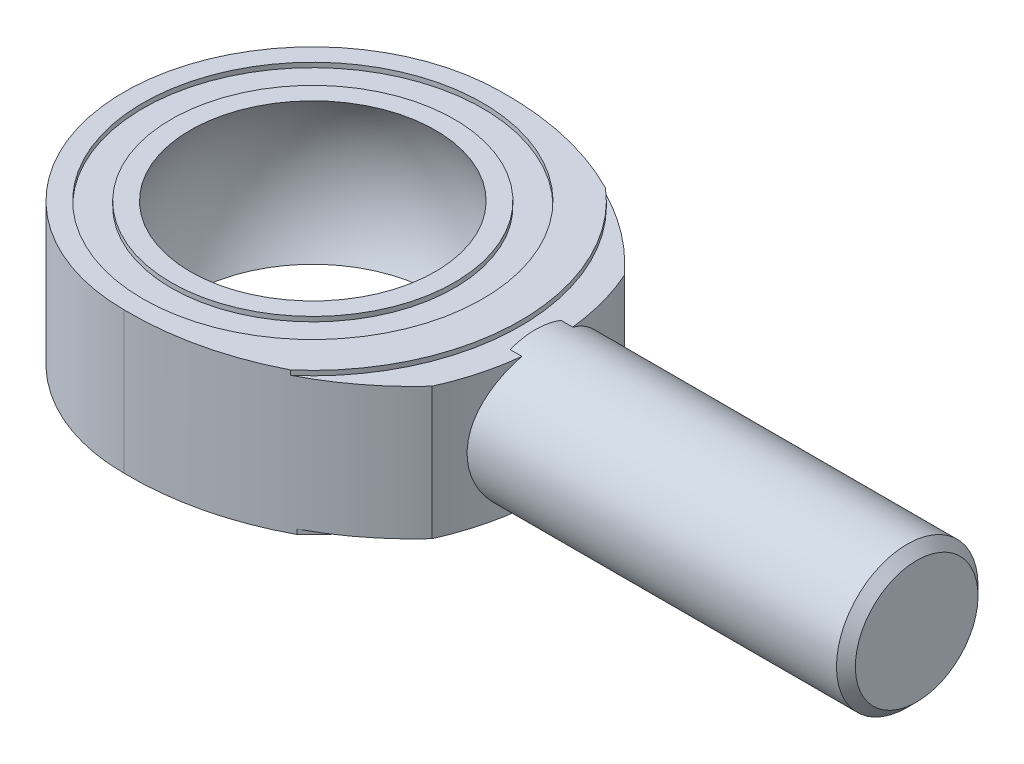
ISO-10303-21;
HEADER;
FILE_DESCRIPTION(('STEP AP214'),'2;1');
FILE_NAME('part.step','',(''),(''),'','','');
FILE_SCHEMA(('AUTOMOTIVE_DESIGN { 1 0 10303 214 1 1 1 1 }'));
ENDSEC;
DATA;
#1=APPLICATION_CONTEXT('core data for automotive mechanical design processes');
#2=APPLICATION_PROTOCOL_DEFINITION('international standard','automotive_design',2000,#1);
#3=PRODUCT_CONTEXT('',#1,'mechanical');
#4=PRODUCT('Part','Part','',(#3));
#5=PRODUCT_RELATED_PRODUCT_CATEGORY('part','',(#4));
#6=PRODUCT_DEFINITION_FORMATION('','',#4);
#7=PRODUCT_DEFINITION_CONTEXT('part definition',#1,'design');
#8=PRODUCT_DEFINITION('design','',#6,#7);
#9=PRODUCT_DEFINITION_SHAPE('','',#8);
#10=(LENGTH_UNIT() NAMED_UNIT(*) SI_UNIT(.MILLI.,.METRE.));
#11=(NAMED_UNIT(*) PLANE_ANGLE_UNIT() SI_UNIT($,.RADIAN.));
#12=(NAMED_UNIT(*) SI_UNIT($,.STERADIAN.) SOLID_ANGLE_UNIT());
#13=UNCERTAINTY_MEASURE_WITH_UNIT(LENGTH_MEASURE(1.E-05),#10,'distance_accuracy_value','');
#14=(GEOMETRIC_REPRESENTATION_CONTEXT(3) GLOBAL_UNCERTAINTY_ASSIGNED_CONTEXT((#13)) GLOBAL_UNIT_ASSIGNED_CONTEXT((#10,
#11,#12)) REPRESENTATION_CONTEXT('',''));
#15=CARTESIAN_POINT('',(0.,0.,0.));
#16=DIRECTION('',(0.,0.,1.));
#17=DIRECTION('',(1.,0.,0.));
#18=AXIS2_PLACEMENT_3D('',#15,#16,#17);
#19=CARTESIAN_POINT('',(0.,8.89,0.));
#20=DIRECTION('',(0.,-1.,0.));
#21=DIRECTION('',(0.,0.,-1.));
#22=AXIS2_PLACEMENT_3D('',#19,#20,#21);
#23=CYLINDRICAL_SURFACE('',#22,15.875);
#24=CARTESIAN_POINT('',(0.,0.,0.));
#25=DIRECTION('',(0.,1.,0.));
#26=DIRECTION('',(0.,0.,1.));
#27=AXIS2_PLACEMENT_3D('',#24,#25,#26);
#28=CIRCLE('',#27,15.875);
#29=CARTESIAN_POINT('',(14.4997686155587,0.,6.46315210212935));
#30=VERTEX_POINT('',#29);
#31=CARTESIAN_POINT('',(15.7826564224784,0.,1.70978982626521));
#32=VERTEX_POINT('',#31);
#33=EDGE_CURVE('E248',#30,#32,#28,.T.);
#34=ORIENTED_EDGE('',*,*,#33,.T.);
#35=CARTESIAN_POINT('',(15.143784822494,4.445,-4.7625));
#36=CARTESIAN_POINT('',(15.1437875218597,4.1840323102802,-4.76249674987404));
#37=CARTESIAN_POINT('',(15.1506043891455,3.92303246334201,-4.74097693430731));
#38=CARTESIAN_POINT('',(15.1770263611095,3.4086633325463,-4.65568806118374));
#39=CARTESIAN_POINT('',(15.1966357386656,3.15529662785804,-4.59190488696095));
#40=CARTESIAN_POINT('',(15.2462262539208,2.66371473773706,-4.42444991632123));
#41=CARTESIAN_POINT('',(15.2761901328282,2.4254751159149,-4.32084446326727));
#42=CARTESIAN_POINT('',(15.3430901083847,1.96970035956497,-4.07690389589421));
#43=CARTESIAN_POINT('',(15.3800272485522,1.75216833117692,-3.93656328310141));
#44=CARTESIAN_POINT('',(15.4580228743982,1.33709920991682,-3.61838094399666));
#45=CARTESIAN_POINT('',(15.4991691638945,1.14031427402053,-3.43957932783186));
#46=CARTESIAN_POINT('',(15.580196866492,0.779024504551037,-3.05160755431522));
#47=CARTESIAN_POINT('',(15.6200781164521,0.614523820321635,-2.84243349933903));
#48=CARTESIAN_POINT('',(15.6950795628956,0.31920592802925,-2.39430381499497));
#49=CARTESIAN_POINT('',(15.7300842478713,0.18915562739408,-2.15482176774121));
#50=CARTESIAN_POINT('',(15.7903683404817,-0.0285345474607519,-1.6561582490477));
#51=CARTESIAN_POINT('',(15.8156498453165,-0.1161835682974,-1.39698104013162));
#52=CARTESIAN_POINT('',(15.8530177606139,-0.244094003462367,-0.874153232102885));
#53=CARTESIAN_POINT('',(15.8654609464764,-0.285639280297336,-0.610842691678321));
#54=CARTESIAN_POINT('',(15.8770066476678,-0.324222505752444,-0.0807142904040737));
#55=CARTESIAN_POINT('',(15.8761119650445,-0.321269802601214,0.186102822009928));
#56=CARTESIAN_POINT('',(15.8613349212105,-0.271802642375919,0.706663422205498));
#57=CARTESIAN_POINT('',(15.8478670915163,-0.226678509653732,0.960552649761222));
#58=CARTESIAN_POINT('',(15.8099608270755,-0.0964205082180648,1.45697325268006));
#59=CARTESIAN_POINT('',(15.7855216975838,-0.0112841057567724,1.69950390770017));
#60=CARTESIAN_POINT('',(15.7278457663334,0.197523174353669,2.16962776116518));
#61=CARTESIAN_POINT('',(15.6945098122253,0.321631318912136,2.39701408040446));
#62=CARTESIAN_POINT('',(15.6225760905863,0.60451318146056,2.82817783926202));
#63=CARTESIAN_POINT('',(15.5839770755373,0.763295123662561,3.03194966022089));
#64=CARTESIAN_POINT('',(15.5038917279599,1.11822785863268,3.41839702885516));
#65=CARTESIAN_POINT('',(15.4623514513069,1.31558321790561,3.59995654276612));
#66=CARTESIAN_POINT('',(15.3823663615776,1.73834430681472,3.92771793639682));
#67=CARTESIAN_POINT('',(15.3439218563742,1.96375282066241,4.0739163023583));
#68=CARTESIAN_POINT('',(15.2742234259604,2.43916031482456,4.32796935187849));
#69=CARTESIAN_POINT('',(15.2430419874785,2.68937437044276,4.43544290820137));
#70=CARTESIAN_POINT('',(15.1922604613002,3.20550288663602,4.60639677129299));
#71=CARTESIAN_POINT('',(15.1726565957717,3.47141219456815,4.66989142981197));
#72=CARTESIAN_POINT('',(15.1480789734703,4.00076149538512,4.74899895648147));
#73=CARTESIAN_POINT('',(15.1425871479299,4.26392411087354,4.76630829757781));
#74=CARTESIAN_POINT('',(15.1454228598877,4.78940145752118,4.75729132464364));
#75=CARTESIAN_POINT('',(15.1537484629337,5.05171630221775,4.73097111878812));
#76=CARTESIAN_POINT('',(15.1827724841554,5.56097560006013,4.63695299348211));
#77=CARTESIAN_POINT('',(15.2031438541227,5.80814232153739,4.57034777544357));
#78=CARTESIAN_POINT('',(15.2536252340815,6.28777536833666,4.39891734349667));
#79=CARTESIAN_POINT('',(15.2837367476479,6.52023941739612,4.2940862283825));
#80=CARTESIAN_POINT('',(15.3513102619845,6.97076794842921,4.045961910489));
#81=CARTESIAN_POINT('',(15.3889478564668,7.18827848912994,3.90171191248418));
#82=CARTESIAN_POINT('',(15.4669555292911,7.596625987124,3.57998082581218));
#83=CARTESIAN_POINT('',(15.5073262601774,7.78745654092059,3.40249178323296));
#84=CARTESIAN_POINT('',(15.5880953651542,8.1444477884618,3.01134504566719));
#85=CARTESIAN_POINT('',(15.6284372807504,8.30940562203367,2.79657513409736));
#86=CARTESIAN_POINT('',(15.7030690430196,8.60096927576311,2.34144116607404));
#87=CARTESIAN_POINT('',(15.7373591902148,8.72757700055614,2.10107838147702));
#88=CARTESIAN_POINT('',(15.7958145625799,8.93762509705434,1.60317022743908));
#89=CARTESIAN_POINT('',(15.8200551462426,9.02138790130475,1.34577017497014));
#90=CARTESIAN_POINT('',(15.8560128521993,9.14419341747708,0.819689643652063));
#91=CARTESIAN_POINT('',(15.8677335575506,9.18324892438621,0.551012415101359));
#92=CARTESIAN_POINT('',(15.8771127745843,9.21455816487305,0.0211205885777199));
#93=CARTESIAN_POINT('',(15.8752954372839,9.20855630791993,-0.239982943598664));
#94=CARTESIAN_POINT('',(15.8590381467654,9.15409131681523,-0.757299352697026));
#95=CARTESIAN_POINT('',(15.8445989092442,9.10563059019938,-1.01351250607539));
#96=CARTESIAN_POINT('',(15.8048695953749,8.96870297505641,-1.51109620640615));
#97=CARTESIAN_POINT('',(15.7796977045951,8.88067127644018,-1.75259659434008));
#98=CARTESIAN_POINT('',(15.7211059415099,8.66748992143887,-2.21752552986336));
#99=CARTESIAN_POINT('',(15.6876847139384,8.54233416533836,-2.44095109996279));
#100=CARTESIAN_POINT('',(15.6147759150177,8.25381427266272,-2.87115850843302));
#101=CARTESIAN_POINT('',(15.575128454715,8.08935570975926,-3.07717904398516));
#102=CARTESIAN_POINT('',(15.4947473065996,7.72886951703167,-3.45928178903196));
#103=CARTESIAN_POINT('',(15.4540133087578,7.53283279462967,-3.63535534551822));
#104=CARTESIAN_POINT('',(15.374641609628,7.10774302890459,-3.95783655324734));
#105=CARTESIAN_POINT('',(15.3361025714441,6.87788009314596,-4.10320362219627));
#106=CARTESIAN_POINT('',(15.2670683818406,6.39586232220172,-4.35306195441919));
#107=CARTESIAN_POINT('',(15.2365693675568,6.14371827011133,-4.45757285891277));
#108=CARTESIAN_POINT('',(15.190083181138,5.65232412961646,-4.61333667544683));
#109=CARTESIAN_POINT('',(15.1728854162817,5.41461754598507,-4.6691187736135));
#110=CARTESIAN_POINT('',(15.1497361023649,4.93294916858495,-4.74369824800893));
#111=CARTESIAN_POINT('',(15.1437822987541,4.68898863875383,-4.76250303866662));
#112=CARTESIAN_POINT('',(15.143784822494,4.445,-4.7625));
#113=B_SPLINE_CURVE_WITH_KNOTS('',3,(#35,#36,#37,#38,#39,#40,#41,#42,#43,#44,#45,#46,#47,#48,
#49,#50,#51,#52,#53,#54,#55,#56,#57,#58,#59,#60,#61,#62,#63,#64,#65,#66,#67,#68,#69,#70,#71,#72,
#73,#74,#75,#76,#77,#78,#79,#80,#81,#82,#83,#84,#85,#86,#87,#88,#89,#90,#91,#92,#93,#94,#95,#96,
#97,#98,#99,#100,#101,#102,#103,#104,#105,#106,#107,#108,#109,#110,#111,#112),.UNSPECIFIED.,.T.,
.F.,(4,2,2,2,2,2,2,2,2,2,2,2,2,2,2,2,2,2,2,2,2,2,2,2,2,2,2,2,2,2,2,2,2,2,2,2,2,2,4),(0.,
0.782003026781847,1.56426738736257,2.34523411593016,3.12631780555007,3.92979751275349,
4.73338041991291,5.55358107193821,6.37360471491509,7.17017044974845,7.96656884272073,
8.73760400021044,9.50868798951944,10.2887528964077,11.0690030267589,11.8793306679891,
12.6897387966166,13.5079180643571,14.3258302075348,15.113256565175,15.9005726917423,
16.6674353893901,17.4344165232865,18.2219832350308,19.009738648326,19.8272243187768,
20.6446693826261,21.4558686901875,22.2668357787961,23.0465726492639,23.8262653093489,
24.5975853257757,25.369032145184,26.1651631590627,26.9615238210817,27.7816195595954,
28.6013205584787,29.3325916350974,30.063716067439),.UNSPECIFIED.);
#114=CARTESIAN_POINT('',(15.7826564224784,8.89,1.70978982626521));
#115=VERTEX_POINT('',#114);
#116=EDGE_CURVE('E170',#32,#115,#113,.T.);
#117=ORIENTED_EDGE('',*,*,#116,.T.);
#118=CARTESIAN_POINT('',(0.,8.89,0.));
#119=DIRECTION('',(0.,1.,0.));
#120=DIRECTION('',(0.,0.,1.));
#121=AXIS2_PLACEMENT_3D('',#118,#119,#120);
#122=CIRCLE('',#121,15.875);
#123=CARTESIAN_POINT('',(14.4997686155587,8.89,6.46315210212935));
#124=VERTEX_POINT('',#123);
#125=EDGE_CURVE('E247',#124,#115,#122,.T.);
#126=ORIENTED_EDGE('',*,*,#125,.F.);
#127=DIRECTION('',(0.,-1.,0.));
#128=VECTOR('',#127,1.);
#129=CARTESIAN_POINT('',(14.4997686155587,9.2075,6.46315210212935));
#130=LINE('',#129,#128);
#131=EDGE_CURVE('E411',#124,#30,#130,.T.);
#132=ORIENTED_EDGE('',*,*,#131,.T.);
#133=EDGE_LOOP('',(#34,#117,#126,#132));
#134=FACE_BOUND('',#133,.T.);
#135=ADVANCED_FACE('F48',(#134),#23,.T.);
#136=CARTESIAN_POINT('',(0.,9.2075,0.));
#137=DIRECTION('',(0.,1.,0.));
#138=DIRECTION('',(0.,0.,1.));
#139=AXIS2_PLACEMENT_3D('',#136,#137,#138);
#140=PLANE('',#139);
#141=CARTESIAN_POINT('',(0.,9.2075,0.));
#142=DIRECTION('',(0.,1.,0.));
#143=DIRECTION('',(0.,0.,1.));
#144=AXIS2_PLACEMENT_3D('',#141,#142,#143);
#145=CIRCLE('',#144,8.24889197104678);
#146=CARTESIAN_POINT('',(0.,9.2075,8.24889197104678));
#147=VERTEX_POINT('',#146);
#148=EDGE_CURVE('E400',#147,#147,#145,.F.);
#149=ORIENTED_EDGE('',*,*,#148,.T.);
#150=EDGE_LOOP('',(#149));
#151=FACE_BOUND('',#150,.T.);
#152=CARTESIAN_POINT('',(0.,9.2075,0.));
#153=DIRECTION('',(0.,1.,0.));
#154=DIRECTION('',(0.,0.,1.));
#155=AXIS2_PLACEMENT_3D('',#152,#153,#154);
#156=CIRCLE('',#155,9.525);
#157=CARTESIAN_POINT('',(0.,9.2075,9.525));
#158=VERTEX_POINT('',#157);
#159=EDGE_CURVE('E386',#158,#158,#156,.T.);
#160=ORIENTED_EDGE('',*,*,#159,.T.);
#161=EDGE_LOOP('',(#160));
#162=FACE_BOUND('',#161,.T.);
#163=ADVANCED_FACE('F220',(#151,#162),#140,.T.);
#164=CARTESIAN_POINT('',(15.7826564224784,8.89,-1.70978982626521));
#165=VERTEX_POINT('',#164);
#166=CARTESIAN_POINT('',(14.4997686155587,8.89,-6.46315210212936));
#167=VERTEX_POINT('',#166);
#168=EDGE_CURVE('E242',#165,#167,#122,.T.);
#169=ORIENTED_EDGE('',*,*,#168,.F.);
#170=CARTESIAN_POINT('',(15.7826564224784,0.,-1.70978982626521));
#171=VERTEX_POINT('',#170);
#172=EDGE_CURVE('E163',#165,#171,#113,.T.);
#173=ORIENTED_EDGE('',*,*,#172,.T.);
#174=CARTESIAN_POINT('',(14.4997686155587,0.,-6.46315210212936));
#175=VERTEX_POINT('',#174);
#176=EDGE_CURVE('E141',#171,#175,#28,.T.);
#177=ORIENTED_EDGE('',*,*,#176,.T.);
#178=DIRECTION('',(0.,-1.,0.));
#179=VECTOR('',#178,1.);
#180=CARTESIAN_POINT('',(14.4997686155587,9.2075,-6.46315210212936));
#181=LINE('',#180,#179);
#182=EDGE_CURVE('E244',#167,#175,#181,.T.);
#183=ORIENTED_EDGE('',*,*,#182,.F.);
#184=EDGE_LOOP('',(#169,#173,#177,#183));
#185=FACE_BOUND('',#184,.T.);
#186=ADVANCED_FACE('F50',(#185),#23,.T.);
#187=CARTESIAN_POINT('',(0.,8.89,0.));
#188=DIRECTION('',(0.,1.,0.));
#189=DIRECTION('',(0.,0.,1.));
#190=AXIS2_PLACEMENT_3D('',#187,#188,#189);
#191=PLANE('',#190);
#192=DIRECTION('',(1.,0.,0.));
#193=VECTOR('',#192,1.);
#194=CARTESIAN_POINT('',(14.986,8.89,1.70978982626521));
#195=LINE('',#194,#193);
#196=CARTESIAN_POINT('',(14.986,8.89,1.70978982626521));
#197=VERTEX_POINT('',#196);
#198=EDGE_CURVE('E69',#197,#115,#195,.T.);
#199=ORIENTED_EDGE('',*,*,#198,.F.);
#200=DIRECTION('',(0.,0.,-1.));
#201=VECTOR('',#200,1.);
#202=CARTESIAN_POINT('',(14.986,8.89,0.));
#203=LINE('',#202,#201);
#204=CARTESIAN_POINT('',(14.986,8.89,-1.70978982626521));
#205=VERTEX_POINT('',#204);
#206=EDGE_CURVE('E64',#197,#205,#203,.T.);
#207=ORIENTED_EDGE('',*,*,#206,.T.);
#208=DIRECTION('',(1.,0.,0.));
#209=VECTOR('',#208,1.);
#210=CARTESIAN_POINT('',(14.986,8.89,-1.70978982626521));
#211=LINE('',#210,#209);
#212=EDGE_CURVE('E169',#165,#205,#211,.F.);
#213=ORIENTED_EDGE('',*,*,#212,.F.);
#214=ORIENTED_EDGE('',*,*,#168,.T.);
#215=CARTESIAN_POINT('',(0.398964105179316,8.89,6.34582178964138));
#216=DIRECTION('',(0.,1.,0.));
#217=DIRECTION('',(0.,0.,1.));
#218=AXIS2_PLACEMENT_3D('',#215,#216,#217);
#219=CIRCLE('',#218,19.05);
#220=CARTESIAN_POINT('',(9.09588133242876,8.89,-10.6031053369461));
#221=VERTEX_POINT('',#220);
#222=EDGE_CURVE('E431',#221,#167,#219,.F.);
#223=ORIENTED_EDGE('',*,*,#222,.F.);
#224=CARTESIAN_POINT('',(0.,8.89,0.));
#225=DIRECTION('',(0.,1.,0.));
#226=DIRECTION('',(0.,0.,1.));
#227=AXIS2_PLACEMENT_3D('',#224,#225,#226);
#228=CIRCLE('',#227,13.97);
#229=CARTESIAN_POINT('',(9.09588133242877,8.89,10.6031053369461));
#230=VERTEX_POINT('',#229);
#231=EDGE_CURVE('E450',#230,#221,#228,.T.);
#232=ORIENTED_EDGE('',*,*,#231,.F.);
#233=CARTESIAN_POINT('',(0.398964105179312,8.89,-6.34582178964138));
#234=DIRECTION('',(0.,1.,0.));
#235=DIRECTION('',(0.,0.,1.));
#236=AXIS2_PLACEMENT_3D('',#233,#234,#235);
#237=CIRCLE('',#236,19.05);
#238=EDGE_CURVE('E439',#230,#124,#237,.T.);
#239=ORIENTED_EDGE('',*,*,#238,.T.);
#240=ORIENTED_EDGE('',*,*,#125,.T.);
#241=EDGE_LOOP('',(#199,#207,#213,#214,#223,#232,#239,#240));
#242=FACE_BOUND('',#241,.T.);
#243=ADVANCED_FACE('F224',(#242),#191,.T.);
#244=CARTESIAN_POINT('',(0.,0.,0.));
#245=DIRECTION('',(0.,1.,0.));
#246=DIRECTION('',(0.,0.,1.));
#247=AXIS2_PLACEMENT_3D('',#244,#245,#246);
#248=PLANE('',#247);
#249=DIRECTION('',(0.,0.,-1.));
#250=VECTOR('',#249,1.);
#251=CARTESIAN_POINT('',(14.986,0.,0.));
#252=LINE('',#251,#250);
#253=CARTESIAN_POINT('',(14.986,0.,1.70978982626521));
#254=VERTEX_POINT('',#253);
#255=CARTESIAN_POINT('',(14.986,0.,-1.70978982626521));
#256=VERTEX_POINT('',#255);
#257=EDGE_CURVE('E138',#254,#256,#252,.T.);
#258=ORIENTED_EDGE('',*,*,#257,.F.);
#259=DIRECTION('',(1.,0.,0.));
#260=VECTOR('',#259,1.);
#261=CARTESIAN_POINT('',(14.986,0.,1.70978982626521));
#262=LINE('',#261,#260);
#263=EDGE_CURVE('E12',#254,#32,#262,.T.);
#264=ORIENTED_EDGE('',*,*,#263,.T.);
#265=ORIENTED_EDGE('',*,*,#33,.F.);
#266=CARTESIAN_POINT('',(0.398964105179312,0.,-6.34582178964138));
#267=DIRECTION('',(0.,1.,0.));
#268=DIRECTION('',(0.,0.,1.));
#269=AXIS2_PLACEMENT_3D('',#266,#267,#268);
#270=CIRCLE('',#269,19.05);
#271=CARTESIAN_POINT('',(9.38254724135972,0.,10.4529202476463));
#272=VERTEX_POINT('',#271);
#273=EDGE_CURVE('E435',#272,#30,#270,.T.);
#274=ORIENTED_EDGE('',*,*,#273,.F.);
#275=CARTESIAN_POINT('',(0.,0.,0.));
#276=DIRECTION('',(0.,-1.,0.));
#277=DIRECTION('',(0.,0.,-1.));
#278=AXIS2_PLACEMENT_3D('',#275,#276,#277);
#279=CIRCLE('',#278,14.0462);
#280=CARTESIAN_POINT('',(9.38254724135972,0.,-10.4529202476463));
#281=VERTEX_POINT('',#280);
#282=EDGE_CURVE('E446',#281,#272,#279,.T.);
#283=ORIENTED_EDGE('',*,*,#282,.F.);
#284=CARTESIAN_POINT('',(0.398964105179316,0.,6.34582178964138));
#285=DIRECTION('',(0.,1.,0.));
#286=DIRECTION('',(0.,0.,1.));
#287=AXIS2_PLACEMENT_3D('',#284,#285,#286);
#288=CIRCLE('',#287,19.05);
#289=EDGE_CURVE('E426',#281,#175,#288,.F.);
#290=ORIENTED_EDGE('',*,*,#289,.T.);
#291=ORIENTED_EDGE('',*,*,#176,.F.);
#292=DIRECTION('',(1.,0.,0.));
#293=VECTOR('',#292,1.);
#294=CARTESIAN_POINT('',(14.986,0.,-1.70978982626521));
#295=LINE('',#294,#293);
#296=EDGE_CURVE('E57',#171,#256,#295,.F.);
#297=ORIENTED_EDGE('',*,*,#296,.T.);
#298=EDGE_LOOP('',(#258,#264,#265,#274,#283,#290,#291,#297));
#299=FACE_BOUND('',#298,.T.);
#300=ADVANCED_FACE('F137',(#299),#248,.F.);
#301=CARTESIAN_POINT('',(0.,9.2075,0.));
#302=DIRECTION('',(0.,-1.,0.));
#303=DIRECTION('',(0.,0.,-1.));
#304=AXIS2_PLACEMENT_3D('',#301,#302,#303);
#305=CYLINDRICAL_SURFACE('',#304,13.97);
#306=DIRECTION('',(0.,-1.,0.));
#307=VECTOR('',#306,1.);
#308=CARTESIAN_POINT('',(9.09588133242877,4.445,10.6031053369461));
#309=LINE('',#308,#307);
#310=CARTESIAN_POINT('',(9.09588133242877,9.2075,10.6031053369461));
#311=VERTEX_POINT('',#310);
#312=EDGE_CURVE('E437',#230,#311,#309,.F.);
#313=ORIENTED_EDGE('',*,*,#312,.F.);
#314=ORIENTED_EDGE('',*,*,#231,.T.);
#315=DIRECTION('',(0.,-1.,0.));
#316=VECTOR('',#315,1.);
#317=CARTESIAN_POINT('',(9.09588133242876,4.445,-10.6031053369461));
#318=LINE('',#317,#316);
#319=CARTESIAN_POINT('',(9.09588133242876,9.2075,-10.6031053369461));
#320=VERTEX_POINT('',#319);
#321=EDGE_CURVE('E428',#221,#320,#318,.F.);
#322=ORIENTED_EDGE('',*,*,#321,.T.);
#323=CARTESIAN_POINT('',(0.,9.2075,0.));
#324=DIRECTION('',(0.,1.,0.));
#325=DIRECTION('',(0.,0.,1.));
#326=AXIS2_PLACEMENT_3D('',#323,#324,#325);
#327=CIRCLE('',#326,13.97);
#328=EDGE_CURVE('E445',#311,#320,#327,.T.);
#329=ORIENTED_EDGE('',*,*,#328,.F.);
#330=EDGE_LOOP('',(#313,#314,#322,#329));
#331=FACE_BOUND('',#330,.T.);
#332=ADVANCED_FACE('F215',(#331),#305,.T.);
#333=CARTESIAN_POINT('',(0.,-0.3175,0.));
#334=DIRECTION('',(0.,1.,0.));
#335=DIRECTION('',(0.,0.,1.));
#336=AXIS2_PLACEMENT_3D('',#333,#334,#335);
#337=CYLINDRICAL_SURFACE('',#336,14.0462);
#338=DIRECTION('',(0.,-1.,0.));
#339=VECTOR('',#338,1.);
#340=CARTESIAN_POINT('',(9.38254724135972,4.445,10.4529202476463));
#341=LINE('',#340,#339);
#342=CARTESIAN_POINT('',(9.38254724135972,-0.3175,10.4529202476463));
#343=VERTEX_POINT('',#342);
#344=EDGE_CURVE('E433',#343,#272,#341,.F.);
#345=ORIENTED_EDGE('',*,*,#344,.F.);
#346=CARTESIAN_POINT('',(0.,-0.3175,0.));
#347=DIRECTION('',(0.,-1.,0.));
#348=DIRECTION('',(0.,0.,-1.));
#349=AXIS2_PLACEMENT_3D('',#346,#347,#348);
#350=CIRCLE('',#349,14.0462);
#351=CARTESIAN_POINT('',(9.38254724135972,-0.3175,-10.4529202476463));
#352=VERTEX_POINT('',#351);
#353=EDGE_CURVE('E442',#352,#343,#350,.T.);
#354=ORIENTED_EDGE('',*,*,#353,.F.);
#355=DIRECTION('',(0.,-1.,0.));
#356=VECTOR('',#355,1.);
#357=CARTESIAN_POINT('',(9.38254724135972,4.445,-10.4529202476463));
#358=LINE('',#357,#356);
#359=EDGE_CURVE('E417',#352,#281,#358,.F.);
#360=ORIENTED_EDGE('',*,*,#359,.T.);
#361=ORIENTED_EDGE('',*,*,#282,.T.);
#362=EDGE_LOOP('',(#345,#354,#360,#361));
#363=FACE_BOUND('',#362,.T.);
#364=ADVANCED_FACE('F212',(#363),#337,.T.);
#365=CARTESIAN_POINT('',(0.,9.2075,0.));
#366=DIRECTION('',(0.,1.,0.));
#367=DIRECTION('',(0.,0.,1.));
#368=AXIS2_PLACEMENT_3D('',#365,#366,#367);
#369=CIRCLE('',#368,11.43);
#370=CARTESIAN_POINT('',(0.,9.2075,11.43));
#371=VERTEX_POINT('',#370);
#372=EDGE_CURVE('E392',#371,#371,#369,.T.);
#373=ORIENTED_EDGE('',*,*,#372,.F.);
#374=EDGE_LOOP('',(#373));
#375=FACE_BOUND('',#374,.T.);
#376=CARTESIAN_POINT('',(0.,9.2075,0.));
#377=DIRECTION('',(0.,-1.,0.));
#378=DIRECTION('',(0.,0.,-1.));
#379=AXIS2_PLACEMENT_3D('',#376,#377,#378);
#380=CIRCLE('',#379,12.7);
#381=CARTESIAN_POINT('',(1.08528637465799E-13,9.2075,12.7));
#382=VERTEX_POINT('',#381);
#383=CARTESIAN_POINT('',(1.01481323344643E-13,9.2075,-12.7));
#384=VERTEX_POINT('',#383);
#385=EDGE_CURVE('E409',#382,#384,#380,.T.);
#386=ORIENTED_EDGE('',*,*,#385,.F.);
#387=CARTESIAN_POINT('',(0.398964105179312,9.2075,-6.34582178964138));
#388=DIRECTION('',(0.,-1.,0.));
#389=DIRECTION('',(0.,0.,-1.));
#390=AXIS2_PLACEMENT_3D('',#387,#388,#389);
#391=CIRCLE('',#390,19.05);
#392=EDGE_CURVE('E404',#311,#382,#391,.T.);
#393=ORIENTED_EDGE('',*,*,#392,.F.);
#394=ORIENTED_EDGE('',*,*,#328,.T.);
#395=CARTESIAN_POINT('',(0.398964105179316,9.2075,6.34582178964138));
#396=DIRECTION('',(0.,-1.,0.));
#397=DIRECTION('',(0.,0.,-1.));
#398=AXIS2_PLACEMENT_3D('',#395,#396,#397);
#399=CIRCLE('',#398,19.05);
#400=EDGE_CURVE('E406',#320,#384,#399,.F.);
#401=ORIENTED_EDGE('',*,*,#400,.T.);
#402=EDGE_LOOP('',(#386,#393,#394,#401));
#403=FACE_BOUND('',#402,.T.);
#404=ADVANCED_FACE('F210',(#375,#403),#140,.T.);
#405=CARTESIAN_POINT('',(0.,-0.3175,0.));
#406=DIRECTION('',(0.,-1.,0.));
#407=DIRECTION('',(0.,0.,-1.));
#408=AXIS2_PLACEMENT_3D('',#405,#406,#407);
#409=PLANE('',#408);
#410=CARTESIAN_POINT('',(0.,-0.3175,0.));
#411=DIRECTION('',(0.,-1.,0.));
#412=DIRECTION('',(0.,0.,-1.));
#413=AXIS2_PLACEMENT_3D('',#410,#411,#412);
#414=CIRCLE('',#413,8.24889197104678);
#415=CARTESIAN_POINT('',(0.,-0.3175,-8.24889197104678));
#416=VERTEX_POINT('',#415);
#417=EDGE_CURVE('E397',#416,#416,#414,.F.);
#418=ORIENTED_EDGE('',*,*,#417,.T.);
#419=EDGE_LOOP('',(#418));
#420=FACE_BOUND('',#419,.T.);
#421=ORIENTED_EDGE('',*,*,#353,.T.);
#422=CARTESIAN_POINT('',(0.398964105179312,-0.3175,-6.34582178964138));
#423=DIRECTION('',(0.,-1.,0.));
#424=DIRECTION('',(0.,0.,-1.));
#425=AXIS2_PLACEMENT_3D('',#422,#423,#424);
#426=CIRCLE('',#425,19.05);
#427=CARTESIAN_POINT('',(1.08528637465799E-13,-0.3175,12.7));
#428=VERTEX_POINT('',#427);
#429=EDGE_CURVE('E149',#343,#428,#426,.T.);
#430=ORIENTED_EDGE('',*,*,#429,.T.);
#431=CARTESIAN_POINT('',(0.,-0.3175,0.));
#432=DIRECTION('',(0.,-1.,0.));
#433=DIRECTION('',(0.,0.,-1.));
#434=AXIS2_PLACEMENT_3D('',#431,#432,#433);
#435=CIRCLE('',#434,12.7);
#436=CARTESIAN_POINT('',(1.01481323344643E-13,-0.3175,-12.7));
#437=VERTEX_POINT('',#436);
#438=EDGE_CURVE('E403',#428,#437,#435,.T.);
#439=ORIENTED_EDGE('',*,*,#438,.T.);
#440=CARTESIAN_POINT('',(0.398964105179316,-0.3175,6.34582178964138));
#441=DIRECTION('',(0.,-1.,0.));
#442=DIRECTION('',(0.,0.,-1.));
#443=AXIS2_PLACEMENT_3D('',#440,#441,#442);
#444=CIRCLE('',#443,19.05);
#445=EDGE_CURVE('E449',#352,#437,#444,.F.);
#446=ORIENTED_EDGE('',*,*,#445,.F.);
#447=EDGE_LOOP('',(#421,#430,#439,#446));
#448=FACE_BOUND('',#447,.T.);
#449=ADVANCED_FACE('F206',(#420,#448),#409,.T.);
#450=CARTESIAN_POINT('',(0.398964105179312,9.2075,-6.34582178964138));
#451=DIRECTION('',(0.,-1.,0.));
#452=DIRECTION('',(0.,0.,-1.));
#453=AXIS2_PLACEMENT_3D('',#450,#451,#452);
#454=CYLINDRICAL_SURFACE('',#453,19.05);
#455=ORIENTED_EDGE('',*,*,#312,.T.);
#456=ORIENTED_EDGE('',*,*,#392,.T.);
#457=DIRECTION('',(0.,-1.,0.));
#458=VECTOR('',#457,1.);
#459=CARTESIAN_POINT('',(1.08528637465799E-13,9.2075,12.7));
#460=LINE('',#459,#458);
#461=EDGE_CURVE('E414',#382,#428,#460,.T.);
#462=ORIENTED_EDGE('',*,*,#461,.T.);
#463=ORIENTED_EDGE('',*,*,#429,.F.);
#464=ORIENTED_EDGE('',*,*,#344,.T.);
#465=ORIENTED_EDGE('',*,*,#273,.T.);
#466=ORIENTED_EDGE('',*,*,#131,.F.);
#467=ORIENTED_EDGE('',*,*,#238,.F.);
#468=EDGE_LOOP('',(#455,#456,#462,#463,#464,#465,#466,#467));
#469=FACE_BOUND('',#468,.T.);
#470=ADVANCED_FACE('F202',(#469),#454,.T.);
#471=CARTESIAN_POINT('',(0.398964105179316,9.2075,6.34582178964138));
#472=DIRECTION('',(0.,-1.,0.));
#473=DIRECTION('',(0.,0.,-1.));
#474=AXIS2_PLACEMENT_3D('',#471,#472,#473);
#475=CYLINDRICAL_SURFACE('',#474,19.05);
#476=ORIENTED_EDGE('',*,*,#222,.T.);
#477=ORIENTED_EDGE('',*,*,#182,.T.);
#478=ORIENTED_EDGE('',*,*,#289,.F.);
#479=ORIENTED_EDGE('',*,*,#359,.F.);
#480=ORIENTED_EDGE('',*,*,#445,.T.);
#481=DIRECTION('',(0.,-1.,0.));
#482=VECTOR('',#481,1.);
#483=CARTESIAN_POINT('',(1.01481323344643E-13,9.2075,-12.7));
#484=LINE('',#483,#482);
#485=EDGE_CURVE('E418',#384,#437,#484,.T.);
#486=ORIENTED_EDGE('',*,*,#485,.F.);
#487=ORIENTED_EDGE('',*,*,#400,.F.);
#488=ORIENTED_EDGE('',*,*,#321,.F.);
#489=EDGE_LOOP('',(#476,#477,#478,#479,#480,#486,#487,#488));
#490=FACE_BOUND('',#489,.T.);
#491=ADVANCED_FACE('F198',(#490),#475,.T.);
#492=CARTESIAN_POINT('',(0.,9.2075,0.));
#493=DIRECTION('',(0.,-1.,0.));
#494=DIRECTION('',(0.,0.,-1.));
#495=AXIS2_PLACEMENT_3D('',#492,#493,#494);
#496=CYLINDRICAL_SURFACE('',#495,12.7);
#497=ORIENTED_EDGE('',*,*,#438,.F.);
#498=ORIENTED_EDGE('',*,*,#461,.F.);
#499=ORIENTED_EDGE('',*,*,#385,.T.);
#500=ORIENTED_EDGE('',*,*,#485,.T.);
#501=EDGE_LOOP('',(#497,#498,#499,#500));
#502=FACE_BOUND('',#501,.T.);
#503=ADVANCED_FACE('F194',(#502),#496,.T.);
#504=CARTESIAN_POINT('',(0.,4.445,0.));
#505=DIRECTION('',(0.,-1.,0.));
#506=DIRECTION('',(0.,0.,1.));
#507=AXIS2_PLACEMENT_3D('',#504,#505,#506);
#508=SPHERICAL_SURFACE('',#507,9.525);
#509=ORIENTED_EDGE('',*,*,#148,.F.);
#510=EDGE_LOOP('',(#509));
#511=FACE_BOUND('',#510,.T.);
#512=ORIENTED_EDGE('',*,*,#417,.F.);
#513=EDGE_LOOP('',(#512));
#514=FACE_BOUND('',#513,.T.);
#515=ADVANCED_FACE('F190',(#511,#514),#508,.F.);
#516=CARTESIAN_POINT('',(0.,8.89,0.));
#517=DIRECTION('',(0.,1.,0.));
#518=DIRECTION('',(0.,0.,1.));
#519=AXIS2_PLACEMENT_3D('',#516,#517,#518);
#520=CYLINDRICAL_SURFACE('',#519,11.43);
#521=CARTESIAN_POINT('',(0.,8.89,0.));
#522=DIRECTION('',(0.,1.,0.));
#523=DIRECTION('',(0.,0.,1.));
#524=AXIS2_PLACEMENT_3D('',#521,#522,#523);
#525=CIRCLE('',#524,11.43);
#526=CARTESIAN_POINT('',(0.,8.89,11.43));
#527=VERTEX_POINT('',#526);
#528=EDGE_CURVE('E394',#527,#527,#525,.T.);
#529=ORIENTED_EDGE('',*,*,#528,.F.);
#530=EDGE_LOOP('',(#529));
#531=FACE_BOUND('',#530,.T.);
#532=ORIENTED_EDGE('',*,*,#372,.T.);
#533=EDGE_LOOP('',(#532));
#534=FACE_BOUND('',#533,.T.);
#535=ADVANCED_FACE('F186',(#531,#534),#520,.F.);
#536=CARTESIAN_POINT('',(0.,8.89,0.));
#537=DIRECTION('',(0.,1.,0.));
#538=DIRECTION('',(0.,0.,1.));
#539=AXIS2_PLACEMENT_3D('',#536,#537,#538);
#540=PLANE('',#539);
#541=CARTESIAN_POINT('',(0.,8.89,0.));
#542=DIRECTION('',(0.,1.,0.));
#543=DIRECTION('',(0.,0.,1.));
#544=AXIS2_PLACEMENT_3D('',#541,#542,#543);
#545=CIRCLE('',#544,9.525);
#546=CARTESIAN_POINT('',(0.,8.89,9.525));
#547=VERTEX_POINT('',#546);
#548=EDGE_CURVE('E388',#547,#547,#545,.T.);
#549=ORIENTED_EDGE('',*,*,#548,.F.);
#550=EDGE_LOOP('',(#549));
#551=FACE_BOUND('',#550,.T.);
#552=ORIENTED_EDGE('',*,*,#528,.T.);
#553=EDGE_LOOP('',(#552));
#554=FACE_BOUND('',#553,.T.);
#555=ADVANCED_FACE('F182',(#551,#554),#540,.T.);
#556=CARTESIAN_POINT('',(0.,8.89,0.));
#557=DIRECTION('',(0.,1.,0.));
#558=DIRECTION('',(0.,0.,1.));
#559=AXIS2_PLACEMENT_3D('',#556,#557,#558);
#560=CYLINDRICAL_SURFACE('',#559,9.525);
#561=ORIENTED_EDGE('',*,*,#548,.T.);
#562=EDGE_LOOP('',(#561));
#563=FACE_BOUND('',#562,.T.);
#564=ORIENTED_EDGE('',*,*,#159,.F.);
#565=EDGE_LOOP('',(#564));
#566=FACE_BOUND('',#565,.T.);
#567=ADVANCED_FACE('F179',(#563,#566),#560,.T.);
#568=CARTESIAN_POINT('',(14.986,0.,0.));
#569=DIRECTION('',(1.,0.,0.));
#570=DIRECTION('',(0.,0.,-1.));
#571=AXIS2_PLACEMENT_3D('',#568,#569,#570);
#572=PLANE('',#571);
#573=CARTESIAN_POINT('',(14.986,4.445,0.));
#574=DIRECTION('',(1.,0.,0.));
#575=DIRECTION('',(0.,0.,-1.));
#576=AXIS2_PLACEMENT_3D('',#573,#574,#575);
#577=CIRCLE('',#576,4.7625);
#578=EDGE_CURVE('E148',#254,#256,#577,.T.);
#579=ORIENTED_EDGE('',*,*,#578,.F.);
#580=ORIENTED_EDGE('',*,*,#257,.T.);
#581=EDGE_LOOP('',(#579,#580));
#582=FACE_BOUND('',#581,.T.);
#583=ADVANCED_FACE('F147',(#582),#572,.F.);
#584=CARTESIAN_POINT('',(14.986,4.445,0.));
#585=DIRECTION('',(1.,0.,0.));
#586=DIRECTION('',(0.,0.,-1.));
#587=AXIS2_PLACEMENT_3D('',#584,#585,#586);
#588=CYLINDRICAL_SURFACE('',#587,4.7625);
#589=CARTESIAN_POINT('',(40.005,4.445,0.));
#590=DIRECTION('',(1.,0.,0.));
#591=DIRECTION('',(0.,1.,0.));
#592=AXIS2_PLACEMENT_3D('',#589,#590,#591);
#593=CIRCLE('',#592,4.7625);
#594=CARTESIAN_POINT('',(40.005,9.2075,0.));
#595=VERTEX_POINT('',#594);
#596=EDGE_CURVE('E155',#595,#595,#593,.T.);
#597=ORIENTED_EDGE('',*,*,#596,.F.);
#598=EDGE_LOOP('',(#597));
#599=FACE_BOUND('',#598,.T.);
#600=EDGE_CURVE('E154',#205,#197,#577,.T.);
#601=ORIENTED_EDGE('',*,*,#600,.T.);
#602=ORIENTED_EDGE('',*,*,#198,.T.);
#603=ORIENTED_EDGE('',*,*,#116,.F.);
#604=ORIENTED_EDGE('',*,*,#263,.F.);
#605=ORIENTED_EDGE('',*,*,#578,.T.);
#606=ORIENTED_EDGE('',*,*,#296,.F.);
#607=ORIENTED_EDGE('',*,*,#172,.F.);
#608=ORIENTED_EDGE('',*,*,#212,.T.);
#609=EDGE_LOOP('',(#601,#602,#603,#604,#605,#606,#607,#608));
#610=FACE_BOUND('',#609,.T.);
#611=ADVANCED_FACE('F152',(#599,#610),#588,.T.);
#612=ORIENTED_EDGE('',*,*,#206,.F.);
#613=ORIENTED_EDGE('',*,*,#600,.F.);
#614=EDGE_LOOP('',(#612,#613));
#615=FACE_BOUND('',#614,.T.);
#616=ADVANCED_FACE('F176',(#615),#572,.F.);
#617=CARTESIAN_POINT('',(40.005,4.445,0.));
#618=DIRECTION('',(-1.,0.,0.));
#619=DIRECTION('',(0.,-1.,0.));
#620=AXIS2_PLACEMENT_3D('',#617,#618,#619);
#621=CONICAL_SURFACE('',#620,4.7625,0.78539816339745);
#622=CARTESIAN_POINT('',(40.64,4.445,0.));
#623=DIRECTION('',(1.,0.,0.));
#624=DIRECTION('',(0.,1.,0.));
#625=AXIS2_PLACEMENT_3D('',#622,#623,#624);
#626=CIRCLE('',#625,4.12749999999999);
#627=CARTESIAN_POINT('',(40.64,8.57249999999999,0.));
#628=VERTEX_POINT('',#627);
#629=EDGE_CURVE('E158',#628,#628,#626,.T.);
#630=ORIENTED_EDGE('',*,*,#629,.F.);
#631=EDGE_LOOP('',(#630));
#632=FACE_BOUND('',#631,.T.);
#633=ORIENTED_EDGE('',*,*,#596,.T.);
#634=EDGE_LOOP('',(#633));
#635=FACE_BOUND('',#634,.T.);
#636=ADVANCED_FACE('F253',(#632,#635),#621,.T.);
#637=CARTESIAN_POINT('',(40.64,0.,0.));
#638=DIRECTION('',(1.,0.,0.));
#639=DIRECTION('',(0.,0.,-1.));
#640=AXIS2_PLACEMENT_3D('',#637,#638,#639);
#641=PLANE('',#640);
#642=ORIENTED_EDGE('',*,*,#629,.T.);
#643=EDGE_LOOP('',(#642));
#644=FACE_BOUND('',#643,.T.);
#645=ADVANCED_FACE('F257',(#644),#641,.T.);
#646=CLOSED_SHELL('',(#135,#163,#186,#243,#300,#332,#364,#404,#449,#470,#491,#503,#515,#535,
#555,#567,#583,#611,#616,#636,#645));
#647=MANIFOLD_SOLID_BREP('B2',#646);
#648=ADVANCED_BREP_SHAPE_REPRESENTATION('',(#18,#647),#14);
#649=SHAPE_DEFINITION_REPRESENTATION(#9,#648);
ENDSEC;
END-ISO-10303-21;
